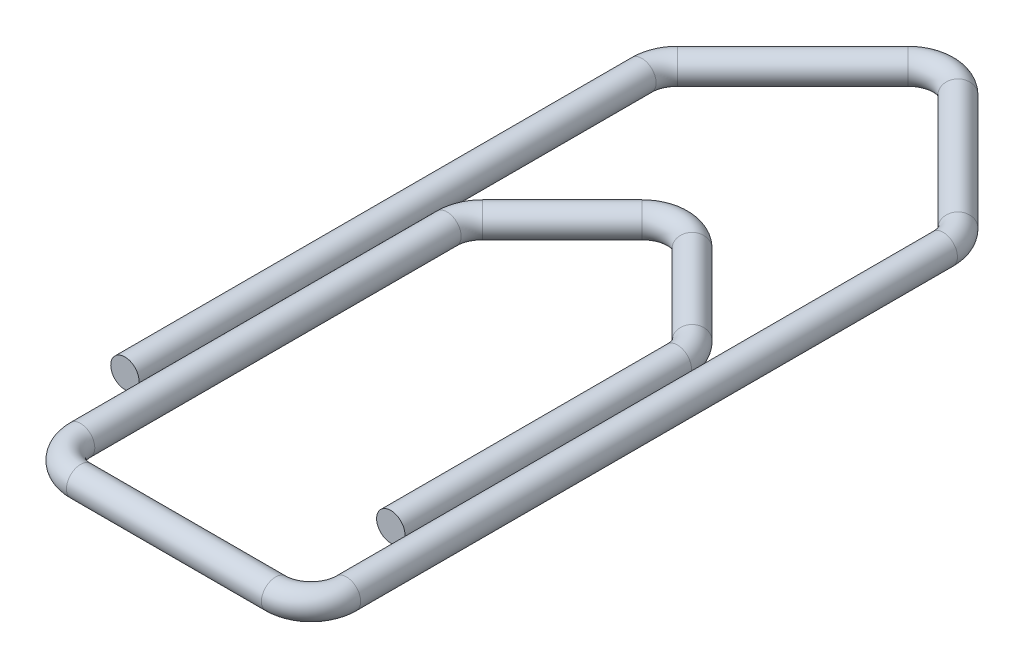
ISO-10303-21;
HEADER;
FILE_DESCRIPTION(('STEP AP214'),'2;1');
FILE_NAME('part.step','',(''),(''),'','','');
FILE_SCHEMA(('AUTOMOTIVE_DESIGN { 1 0 10303 214 1 1 1 1 }'));
ENDSEC;
DATA;
#1=APPLICATION_CONTEXT('core data for automotive mechanical design processes');
#2=APPLICATION_PROTOCOL_DEFINITION('international standard','automotive_design',2000,#1);
#3=PRODUCT_CONTEXT('',#1,'mechanical');
#4=PRODUCT('Part','Part','',(#3));
#5=PRODUCT_RELATED_PRODUCT_CATEGORY('part','',(#4));
#6=PRODUCT_DEFINITION_FORMATION('','',#4);
#7=PRODUCT_DEFINITION_CONTEXT('part definition',#1,'design');
#8=PRODUCT_DEFINITION('design','',#6,#7);
#9=PRODUCT_DEFINITION_SHAPE('','',#8);
#10=(LENGTH_UNIT() NAMED_UNIT(*) SI_UNIT(.MILLI.,.METRE.));
#11=(NAMED_UNIT(*) PLANE_ANGLE_UNIT() SI_UNIT($,.RADIAN.));
#12=(NAMED_UNIT(*) SI_UNIT($,.STERADIAN.) SOLID_ANGLE_UNIT());
#13=UNCERTAINTY_MEASURE_WITH_UNIT(LENGTH_MEASURE(1.E-05),#10,'distance_accuracy_value','');
#14=(GEOMETRIC_REPRESENTATION_CONTEXT(3) GLOBAL_UNCERTAINTY_ASSIGNED_CONTEXT((#13)) GLOBAL_UNIT_ASSIGNED_CONTEXT((#10,
#11,#12)) REPRESENTATION_CONTEXT('',''));
#15=CARTESIAN_POINT('',(0.,0.,0.));
#16=DIRECTION('',(0.,0.,1.));
#17=DIRECTION('',(1.,0.,0.));
#18=AXIS2_PLACEMENT_3D('',#15,#16,#17);
#19=CARTESIAN_POINT('',(0.,0.,0.));
#20=DIRECTION('',(0.,0.,1.));
#21=DIRECTION('',(1.,0.,0.));
#22=AXIS2_PLACEMENT_3D('',#19,#20,#21);
#23=PLANE('',#22);
#24=CARTESIAN_POINT('',(0.,0.,0.));
#25=DIRECTION('',(0.,0.,1.));
#26=DIRECTION('',(1.,0.,0.));
#27=AXIS2_PLACEMENT_3D('',#24,#25,#26);
#28=CIRCLE('',#27,0.8);
#29=CARTESIAN_POINT('',(0.8,0.,0.));
#30=VERTEX_POINT('',#29);
#31=EDGE_CURVE('E45',#30,#30,#28,.T.);
#32=ORIENTED_EDGE('',*,*,#31,.T.);
#33=EDGE_LOOP('',(#32));
#34=FACE_BOUND('',#33,.T.);
#35=ADVANCED_FACE('F33',(#34),#23,.T.);
#36=CARTESIAN_POINT('',(15.,0.,0.));
#37=DIRECTION('',(0.,0.,-1.));
#38=DIRECTION('',(-1.,0.,0.));
#39=AXIS2_PLACEMENT_3D('',#36,#37,#38);
#40=PLANE('',#39);
#41=CARTESIAN_POINT('',(15.,0.,0.));
#42=DIRECTION('',(0.,0.,-1.));
#43=DIRECTION('',(-1.,0.,0.));
#44=AXIS2_PLACEMENT_3D('',#41,#42,#43);
#45=CIRCLE('',#44,0.8);
#46=CARTESIAN_POINT('',(14.2,0.,0.));
#47=VERTEX_POINT('',#46);
#48=EDGE_CURVE('E11',#47,#47,#45,.T.);
#49=ORIENTED_EDGE('',*,*,#48,.F.);
#50=EDGE_LOOP('',(#49));
#51=FACE_BOUND('',#50,.T.);
#52=ADVANCED_FACE('F51',(#51),#40,.F.);
#53=CARTESIAN_POINT('',(0.,0.,0.));
#54=DIRECTION('',(0.,0.,-1.));
#55=DIRECTION('',(-1.,0.,0.));
#56=AXIS2_PLACEMENT_3D('',#53,#54,#55);
#57=CYLINDRICAL_SURFACE('',#56,0.8);
#58=CARTESIAN_POINT('',(0.,0.,-29.1715728752538));
#59=DIRECTION('',(0.,0.,1.));
#60=DIRECTION('',(1.,0.,0.));
#61=AXIS2_PLACEMENT_3D('',#58,#59,#60);
#62=CIRCLE('',#61,0.8);
#63=CARTESIAN_POINT('',(-0.8,0.,-29.1715728752538));
#64=VERTEX_POINT('',#63);
#65=EDGE_CURVE('E133',#64,#64,#62,.T.);
#66=ORIENTED_EDGE('',*,*,#65,.T.);
#67=EDGE_LOOP('',(#66));
#68=FACE_BOUND('',#67,.T.);
#69=ORIENTED_EDGE('',*,*,#31,.F.);
#70=EDGE_LOOP('',(#69));
#71=FACE_BOUND('',#70,.T.);
#72=ADVANCED_FACE('F53',(#68,#71),#57,.T.);
#73=CARTESIAN_POINT('',(2.,0.,-29.1715728752538));
#74=DIRECTION('',(0.,-1.,0.));
#75=DIRECTION('',(0.,0.,-1.));
#76=AXIS2_PLACEMENT_3D('',#73,#74,#75);
#77=TOROIDAL_SURFACE('',#76,2.,0.8);
#78=CARTESIAN_POINT('',(0.58578643762691,0.,-30.5857864376269));
#79=DIRECTION('',(-0.70710678118655,0.,0.707106781186545));
#80=DIRECTION('',(0.707106781186545,0.,0.70710678118655));
#81=AXIS2_PLACEMENT_3D('',#78,#79,#80);
#82=CIRCLE('',#81,0.8);
#83=CARTESIAN_POINT('',(0.0201010126776738,0.,-31.1514718625761));
#84=VERTEX_POINT('',#83);
#85=EDGE_CURVE('E130',#84,#84,#82,.T.);
#86=CARTESIAN_POINT('',(2.,0.,-29.1715728752538));
#87=DIRECTION('',(0.,-1.,0.));
#88=DIRECTION('',(0.,0.,-1.));
#89=AXIS2_PLACEMENT_3D('',#86,#87,#88);
#90=CIRCLE('',#89,2.8);
#91=EDGE_CURVE('',#64,#84,#90,.T.);
#92=ORIENTED_EDGE('',*,*,#65,.F.);
#93=ORIENTED_EDGE('',*,*,#85,.T.);
#94=ORIENTED_EDGE('',*,*,#91,.T.);
#95=ORIENTED_EDGE('',*,*,#91,.F.);
#96=EDGE_LOOP('',(#92,#94,#93,#95));
#97=FACE_BOUND('',#96,.T.);
#98=ADVANCED_FACE('F58',(#97),#77,.T.);
#99=CARTESIAN_POINT('',(0.58578643762691,0.,-30.5857864376269));
#100=DIRECTION('',(0.707106781186547,0.,-0.707106781186548));
#101=DIRECTION('',(-0.707106781186548,0.,-0.707106781186547));
#102=AXIS2_PLACEMENT_3D('',#99,#100,#101);
#103=CYLINDRICAL_SURFACE('',#102,0.8);
#104=CARTESIAN_POINT('',(7.08578643762689,0.,-37.0857864376269));
#105=DIRECTION('',(-0.707106781186547,0.,0.707106781186548));
#106=DIRECTION('',(0.707106781186548,0.,0.707106781186547));
#107=AXIS2_PLACEMENT_3D('',#104,#105,#106);
#108=CIRCLE('',#107,0.8);
#109=CARTESIAN_POINT('',(6.52010101267765,0.,-37.6514718625761));
#110=VERTEX_POINT('',#109);
#111=EDGE_CURVE('E135',#110,#110,#108,.T.);
#112=ORIENTED_EDGE('',*,*,#111,.T.);
#113=EDGE_LOOP('',(#112));
#114=FACE_BOUND('',#113,.T.);
#115=ORIENTED_EDGE('',*,*,#85,.F.);
#116=EDGE_LOOP('',(#115));
#117=FACE_BOUND('',#116,.T.);
#118=ADVANCED_FACE('F118',(#114,#117),#103,.T.);
#119=CARTESIAN_POINT('',(8.5,0.,-35.6715728752538));
#120=DIRECTION('',(0.,-1.,0.));
#121=DIRECTION('',(0.,0.,-1.));
#122=AXIS2_PLACEMENT_3D('',#119,#120,#121);
#123=TOROIDAL_SURFACE('',#122,2.,0.8);
#124=CARTESIAN_POINT('',(9.9142135623731,0.,-37.0857864376269));
#125=DIRECTION('',(-0.707106781186542,0.,-0.707106781186553));
#126=DIRECTION('',(-0.707106781186553,0.,0.707106781186542));
#127=AXIS2_PLACEMENT_3D('',#124,#125,#126);
#128=CIRCLE('',#127,0.8);
#129=CARTESIAN_POINT('',(10.4798989873223,0.,-37.6514718625761));
#130=VERTEX_POINT('',#129);
#131=EDGE_CURVE('E141',#130,#130,#128,.T.);
#132=CARTESIAN_POINT('',(8.5,0.,-35.6715728752538));
#133=DIRECTION('',(0.,-1.,0.));
#134=DIRECTION('',(0.,0.,-1.));
#135=AXIS2_PLACEMENT_3D('',#132,#133,#134);
#136=CIRCLE('',#135,2.8);
#137=EDGE_CURVE('',#110,#130,#136,.T.);
#138=ORIENTED_EDGE('',*,*,#111,.F.);
#139=ORIENTED_EDGE('',*,*,#131,.T.);
#140=ORIENTED_EDGE('',*,*,#137,.T.);
#141=ORIENTED_EDGE('',*,*,#137,.F.);
#142=EDGE_LOOP('',(#138,#140,#139,#141));
#143=FACE_BOUND('',#142,.T.);
#144=ADVANCED_FACE('F114',(#143),#123,.T.);
#145=CARTESIAN_POINT('',(9.9142135623731,0.,-37.0857864376269));
#146=DIRECTION('',(0.707106781186548,0.,0.707106781186547));
#147=DIRECTION('',(0.707106781186547,0.,-0.707106781186548));
#148=AXIS2_PLACEMENT_3D('',#145,#146,#147);
#149=CYLINDRICAL_SURFACE('',#148,0.8);
#150=CARTESIAN_POINT('',(16.4142135623731,0.,-30.5857864376269));
#151=DIRECTION('',(-0.707106781186548,0.,-0.707106781186547));
#152=DIRECTION('',(-0.707106781186547,0.,0.707106781186548));
#153=AXIS2_PLACEMENT_3D('',#150,#151,#152);
#154=CIRCLE('',#153,0.8);
#155=CARTESIAN_POINT('',(16.9798989873223,0.,-31.1514718625762));
#156=VERTEX_POINT('',#155);
#157=EDGE_CURVE('E144',#156,#156,#154,.T.);
#158=ORIENTED_EDGE('',*,*,#157,.T.);
#159=EDGE_LOOP('',(#158));
#160=FACE_BOUND('',#159,.T.);
#161=ORIENTED_EDGE('',*,*,#131,.F.);
#162=EDGE_LOOP('',(#161));
#163=FACE_BOUND('',#162,.T.);
#164=ADVANCED_FACE('F110',(#160,#163),#149,.T.);
#165=CARTESIAN_POINT('',(15.,0.,-29.1715728752538));
#166=DIRECTION('',(0.,-1.,0.));
#167=DIRECTION('',(0.,0.,-1.));
#168=AXIS2_PLACEMENT_3D('',#165,#166,#167);
#169=TOROIDAL_SURFACE('',#168,2.,0.8);
#170=CARTESIAN_POINT('',(17.,0.,-29.1715728752538));
#171=DIRECTION('',(0.,0.,-1.));
#172=DIRECTION('',(-1.,0.,0.));
#173=AXIS2_PLACEMENT_3D('',#170,#171,#172);
#174=CIRCLE('',#173,0.8);
#175=CARTESIAN_POINT('',(17.8,0.,-29.1715728752538));
#176=VERTEX_POINT('',#175);
#177=EDGE_CURVE('E147',#176,#176,#174,.T.);
#178=CARTESIAN_POINT('',(15.,0.,-29.1715728752538));
#179=DIRECTION('',(0.,-1.,0.));
#180=DIRECTION('',(0.,0.,-1.));
#181=AXIS2_PLACEMENT_3D('',#178,#179,#180);
#182=CIRCLE('',#181,2.8);
#183=EDGE_CURVE('',#156,#176,#182,.T.);
#184=ORIENTED_EDGE('',*,*,#157,.F.);
#185=ORIENTED_EDGE('',*,*,#177,.T.);
#186=ORIENTED_EDGE('',*,*,#183,.T.);
#187=ORIENTED_EDGE('',*,*,#183,.F.);
#188=EDGE_LOOP('',(#184,#186,#185,#187));
#189=FACE_BOUND('',#188,.T.);
#190=ADVANCED_FACE('F106',(#189),#169,.T.);
#191=CARTESIAN_POINT('',(17.,0.,-29.1715728752538));
#192=DIRECTION('',(0.,0.,1.));
#193=DIRECTION('',(1.,0.,0.));
#194=AXIS2_PLACEMENT_3D('',#191,#192,#193);
#195=CYLINDRICAL_SURFACE('',#194,0.8);
#196=CARTESIAN_POINT('',(17.,0.,4.49999999999998));
#197=DIRECTION('',(0.,0.,-1.));
#198=DIRECTION('',(-1.,0.,0.));
#199=AXIS2_PLACEMENT_3D('',#196,#197,#198);
#200=CIRCLE('',#199,0.8);
#201=CARTESIAN_POINT('',(17.8,0.,4.49999999999998));
#202=VERTEX_POINT('',#201);
#203=EDGE_CURVE('E150',#202,#202,#200,.T.);
#204=ORIENTED_EDGE('',*,*,#203,.T.);
#205=EDGE_LOOP('',(#204));
#206=FACE_BOUND('',#205,.T.);
#207=ORIENTED_EDGE('',*,*,#177,.F.);
#208=EDGE_LOOP('',(#207));
#209=FACE_BOUND('',#208,.T.);
#210=ADVANCED_FACE('F102',(#206,#209),#195,.T.);
#211=CARTESIAN_POINT('',(15.,0.,4.49999999999999));
#212=DIRECTION('',(0.,-1.,0.));
#213=DIRECTION('',(0.,0.,-1.));
#214=AXIS2_PLACEMENT_3D('',#211,#212,#213);
#215=TOROIDAL_SURFACE('',#214,2.,0.8);
#216=CARTESIAN_POINT('',(15.,0.,6.49999999999999));
#217=DIRECTION('',(1.,0.,0.));
#218=DIRECTION('',(0.,0.,-1.));
#219=AXIS2_PLACEMENT_3D('',#216,#217,#218);
#220=CIRCLE('',#219,0.8);
#221=CARTESIAN_POINT('',(15.,0.,7.29999999999999));
#222=VERTEX_POINT('',#221);
#223=EDGE_CURVE('E153',#222,#222,#220,.T.);
#224=CARTESIAN_POINT('',(15.,0.,4.49999999999999));
#225=DIRECTION('',(0.,-1.,0.));
#226=DIRECTION('',(0.,0.,-1.));
#227=AXIS2_PLACEMENT_3D('',#224,#225,#226);
#228=CIRCLE('',#227,2.8);
#229=EDGE_CURVE('',#202,#222,#228,.T.);
#230=ORIENTED_EDGE('',*,*,#203,.F.);
#231=ORIENTED_EDGE('',*,*,#223,.T.);
#232=ORIENTED_EDGE('',*,*,#229,.T.);
#233=ORIENTED_EDGE('',*,*,#229,.F.);
#234=EDGE_LOOP('',(#230,#232,#231,#233));
#235=FACE_BOUND('',#234,.T.);
#236=ADVANCED_FACE('F98',(#235),#215,.T.);
#237=CARTESIAN_POINT('',(15.,0.,6.49999999999999));
#238=DIRECTION('',(-1.,0.,0.));
#239=DIRECTION('',(0.,0.,1.));
#240=AXIS2_PLACEMENT_3D('',#237,#238,#239);
#241=CYLINDRICAL_SURFACE('',#240,0.8);
#242=CARTESIAN_POINT('',(4.00000000000002,0.,6.49999999999999));
#243=DIRECTION('',(1.,0.,0.));
#244=DIRECTION('',(0.,0.,-1.));
#245=AXIS2_PLACEMENT_3D('',#242,#243,#244);
#246=CIRCLE('',#245,0.8);
#247=CARTESIAN_POINT('',(4.00000000000002,0.,7.29999999999999));
#248=VERTEX_POINT('',#247);
#249=EDGE_CURVE('E156',#248,#248,#246,.T.);
#250=ORIENTED_EDGE('',*,*,#249,.T.);
#251=EDGE_LOOP('',(#250));
#252=FACE_BOUND('',#251,.T.);
#253=ORIENTED_EDGE('',*,*,#223,.F.);
#254=EDGE_LOOP('',(#253));
#255=FACE_BOUND('',#254,.T.);
#256=ADVANCED_FACE('F94',(#252,#255),#241,.T.);
#257=CARTESIAN_POINT('',(4.00000000000001,0.,4.49999999999999));
#258=DIRECTION('',(0.,-1.,0.));
#259=DIRECTION('',(0.,0.,-1.));
#260=AXIS2_PLACEMENT_3D('',#257,#258,#259);
#261=TOROIDAL_SURFACE('',#260,2.,0.8);
#262=CARTESIAN_POINT('',(2.00000000000001,0.,4.49999999999998));
#263=DIRECTION('',(0.,0.,1.));
#264=DIRECTION('',(1.,0.,0.));
#265=AXIS2_PLACEMENT_3D('',#262,#263,#264);
#266=CIRCLE('',#265,0.8);
#267=CARTESIAN_POINT('',(1.20000000000001,0.,4.49999999999997));
#268=VERTEX_POINT('',#267);
#269=EDGE_CURVE('E159',#268,#268,#266,.T.);
#270=CARTESIAN_POINT('',(4.00000000000001,0.,4.49999999999999));
#271=DIRECTION('',(0.,-1.,0.));
#272=DIRECTION('',(0.,0.,-1.));
#273=AXIS2_PLACEMENT_3D('',#270,#271,#272);
#274=CIRCLE('',#273,2.8);
#275=EDGE_CURVE('',#248,#268,#274,.T.);
#276=ORIENTED_EDGE('',*,*,#249,.F.);
#277=ORIENTED_EDGE('',*,*,#269,.T.);
#278=ORIENTED_EDGE('',*,*,#275,.T.);
#279=ORIENTED_EDGE('',*,*,#275,.F.);
#280=EDGE_LOOP('',(#276,#278,#277,#279));
#281=FACE_BOUND('',#280,.T.);
#282=ADVANCED_FACE('F90',(#281),#261,.T.);
#283=CARTESIAN_POINT('',(2.00000000000001,0.,4.49999999999998));
#284=DIRECTION('',(0.,0.,-1.));
#285=DIRECTION('',(-1.,0.,0.));
#286=AXIS2_PLACEMENT_3D('',#283,#284,#285);
#287=CYLINDRICAL_SURFACE('',#286,0.8);
#288=CARTESIAN_POINT('',(2.00000000000001,0.,-16.1715728752538));
#289=DIRECTION('',(0.,0.,1.));
#290=DIRECTION('',(1.,0.,0.));
#291=AXIS2_PLACEMENT_3D('',#288,#289,#290);
#292=CIRCLE('',#291,0.8);
#293=CARTESIAN_POINT('',(1.20000000000001,0.,-16.1715728752538));
#294=VERTEX_POINT('',#293);
#295=EDGE_CURVE('E162',#294,#294,#292,.T.);
#296=ORIENTED_EDGE('',*,*,#295,.T.);
#297=EDGE_LOOP('',(#296));
#298=FACE_BOUND('',#297,.T.);
#299=ORIENTED_EDGE('',*,*,#269,.F.);
#300=EDGE_LOOP('',(#299));
#301=FACE_BOUND('',#300,.T.);
#302=ADVANCED_FACE('F86',(#298,#301),#287,.T.);
#303=CARTESIAN_POINT('',(4.00000000000001,0.,-16.1715728752538));
#304=DIRECTION('',(0.,-1.,0.));
#305=DIRECTION('',(0.,0.,-1.));
#306=AXIS2_PLACEMENT_3D('',#303,#304,#305);
#307=TOROIDAL_SURFACE('',#306,2.,0.8);
#308=CARTESIAN_POINT('',(2.58578643762692,0.,-17.5857864376269));
#309=DIRECTION('',(-0.70710678118655,0.,0.707106781186545));
#310=DIRECTION('',(0.707106781186545,0.,0.70710678118655));
#311=AXIS2_PLACEMENT_3D('',#308,#309,#310);
#312=CIRCLE('',#311,0.8);
#313=CARTESIAN_POINT('',(2.02010101267768,0.,-18.1514718625762));
#314=VERTEX_POINT('',#313);
#315=EDGE_CURVE('E165',#314,#314,#312,.T.);
#316=CARTESIAN_POINT('',(4.00000000000001,0.,-16.1715728752538));
#317=DIRECTION('',(0.,-1.,0.));
#318=DIRECTION('',(0.,0.,-1.));
#319=AXIS2_PLACEMENT_3D('',#316,#317,#318);
#320=CIRCLE('',#319,2.8);
#321=EDGE_CURVE('',#294,#314,#320,.T.);
#322=ORIENTED_EDGE('',*,*,#295,.F.);
#323=ORIENTED_EDGE('',*,*,#315,.T.);
#324=ORIENTED_EDGE('',*,*,#321,.T.);
#325=ORIENTED_EDGE('',*,*,#321,.F.);
#326=EDGE_LOOP('',(#322,#324,#323,#325));
#327=FACE_BOUND('',#326,.T.);
#328=ADVANCED_FACE('F82',(#327),#307,.T.);
#329=CARTESIAN_POINT('',(2.58578643762692,0.,-17.5857864376269));
#330=DIRECTION('',(0.707106781186547,0.,-0.707106781186548));
#331=DIRECTION('',(-0.707106781186548,0.,-0.707106781186547));
#332=AXIS2_PLACEMENT_3D('',#329,#330,#331);
#333=CYLINDRICAL_SURFACE('',#332,0.8);
#334=CARTESIAN_POINT('',(7.08578643762689,0.,-22.0857864376269));
#335=DIRECTION('',(-0.707106781186547,0.,0.707106781186548));
#336=DIRECTION('',(0.707106781186548,0.,0.707106781186547));
#337=AXIS2_PLACEMENT_3D('',#334,#335,#336);
#338=CIRCLE('',#337,0.8);
#339=CARTESIAN_POINT('',(6.52010101267765,0.,-22.6514718625761));
#340=VERTEX_POINT('',#339);
#341=EDGE_CURVE('E168',#340,#340,#338,.T.);
#342=ORIENTED_EDGE('',*,*,#341,.T.);
#343=EDGE_LOOP('',(#342));
#344=FACE_BOUND('',#343,.T.);
#345=ORIENTED_EDGE('',*,*,#315,.F.);
#346=EDGE_LOOP('',(#345));
#347=FACE_BOUND('',#346,.T.);
#348=ADVANCED_FACE('F78',(#344,#347),#333,.T.);
#349=CARTESIAN_POINT('',(8.5,0.,-20.6715728752538));
#350=DIRECTION('',(0.,-1.,0.));
#351=DIRECTION('',(0.,0.,-1.));
#352=AXIS2_PLACEMENT_3D('',#349,#350,#351);
#353=TOROIDAL_SURFACE('',#352,2.,0.8);
#354=CARTESIAN_POINT('',(9.9142135623731,0.,-22.0857864376269));
#355=DIRECTION('',(-0.707106781186542,0.,-0.707106781186553));
#356=DIRECTION('',(-0.707106781186553,0.,0.707106781186542));
#357=AXIS2_PLACEMENT_3D('',#354,#355,#356);
#358=CIRCLE('',#357,0.8);
#359=CARTESIAN_POINT('',(10.4798989873223,0.,-22.6514718625761));
#360=VERTEX_POINT('',#359);
#361=EDGE_CURVE('E171',#360,#360,#358,.T.);
#362=CARTESIAN_POINT('',(8.5,0.,-20.6715728752538));
#363=DIRECTION('',(0.,-1.,0.));
#364=DIRECTION('',(0.,0.,-1.));
#365=AXIS2_PLACEMENT_3D('',#362,#363,#364);
#366=CIRCLE('',#365,2.8);
#367=EDGE_CURVE('',#340,#360,#366,.T.);
#368=ORIENTED_EDGE('',*,*,#341,.F.);
#369=ORIENTED_EDGE('',*,*,#361,.T.);
#370=ORIENTED_EDGE('',*,*,#367,.T.);
#371=ORIENTED_EDGE('',*,*,#367,.F.);
#372=EDGE_LOOP('',(#368,#370,#369,#371));
#373=FACE_BOUND('',#372,.T.);
#374=ADVANCED_FACE('F74',(#373),#353,.T.);
#375=CARTESIAN_POINT('',(9.9142135623731,0.,-22.0857864376269));
#376=DIRECTION('',(0.707106781186548,0.,0.707106781186548));
#377=DIRECTION('',(0.707106781186548,0.,-0.707106781186548));
#378=AXIS2_PLACEMENT_3D('',#375,#376,#377);
#379=CYLINDRICAL_SURFACE('',#378,0.8);
#380=CARTESIAN_POINT('',(14.4142135623731,0.,-17.5857864376269));
#381=DIRECTION('',(-0.707106781186547,0.,-0.707106781186547));
#382=DIRECTION('',(-0.707106781186547,0.,0.707106781186547));
#383=AXIS2_PLACEMENT_3D('',#380,#381,#382);
#384=CIRCLE('',#383,0.8);
#385=CARTESIAN_POINT('',(14.9798989873223,0.,-18.1514718625762));
#386=VERTEX_POINT('',#385);
#387=EDGE_CURVE('E174',#386,#386,#384,.T.);
#388=ORIENTED_EDGE('',*,*,#387,.T.);
#389=EDGE_LOOP('',(#388));
#390=FACE_BOUND('',#389,.T.);
#391=ORIENTED_EDGE('',*,*,#361,.F.);
#392=EDGE_LOOP('',(#391));
#393=FACE_BOUND('',#392,.T.);
#394=ADVANCED_FACE('F68',(#390,#393),#379,.T.);
#395=CARTESIAN_POINT('',(13.,0.,-16.1715728752538));
#396=DIRECTION('',(0.,-1.,0.));
#397=DIRECTION('',(0.,0.,-1.));
#398=AXIS2_PLACEMENT_3D('',#395,#396,#397);
#399=TOROIDAL_SURFACE('',#398,2.,0.8);
#400=CARTESIAN_POINT('',(15.,0.,-16.1715728752538));
#401=DIRECTION('',(0.,0.,-1.));
#402=DIRECTION('',(-1.,0.,0.));
#403=AXIS2_PLACEMENT_3D('',#400,#401,#402);
#404=CIRCLE('',#403,0.8);
#405=CARTESIAN_POINT('',(15.8,0.,-16.1715728752538));
#406=VERTEX_POINT('',#405);
#407=EDGE_CURVE('E40',#406,#406,#404,.T.);
#408=CARTESIAN_POINT('',(13.,0.,-16.1715728752538));
#409=DIRECTION('',(0.,-1.,0.));
#410=DIRECTION('',(0.,0.,-1.));
#411=AXIS2_PLACEMENT_3D('',#408,#409,#410);
#412=CIRCLE('',#411,2.8);
#413=EDGE_CURVE('',#386,#406,#412,.T.);
#414=ORIENTED_EDGE('',*,*,#387,.F.);
#415=ORIENTED_EDGE('',*,*,#407,.T.);
#416=ORIENTED_EDGE('',*,*,#413,.T.);
#417=ORIENTED_EDGE('',*,*,#413,.F.);
#418=EDGE_LOOP('',(#414,#416,#415,#417));
#419=FACE_BOUND('',#418,.T.);
#420=ADVANCED_FACE('F64',(#419),#399,.T.);
#421=CARTESIAN_POINT('',(15.,0.,-16.1715728752538));
#422=DIRECTION('',(0.,0.,1.));
#423=DIRECTION('',(1.,0.,0.));
#424=AXIS2_PLACEMENT_3D('',#421,#422,#423);
#425=CYLINDRICAL_SURFACE('',#424,0.8);
#426=ORIENTED_EDGE('',*,*,#48,.T.);
#427=EDGE_LOOP('',(#426));
#428=FACE_BOUND('',#427,.T.);
#429=ORIENTED_EDGE('',*,*,#407,.F.);
#430=EDGE_LOOP('',(#429));
#431=FACE_BOUND('',#430,.T.);
#432=ADVANCED_FACE('F48',(#428,#431),#425,.T.);
#433=CLOSED_SHELL('',(#35,#52,#72,#98,#118,#144,#164,#190,#210,#236,#256,#282,#302,#328,#348,
#374,#394,#420,#432));
#434=MANIFOLD_SOLID_BREP('B2',#433);
#435=ADVANCED_BREP_SHAPE_REPRESENTATION('',(#18,#434),#14);
#436=SHAPE_DEFINITION_REPRESENTATION(#9,#435);
ENDSEC;
END-ISO-10303-21;
